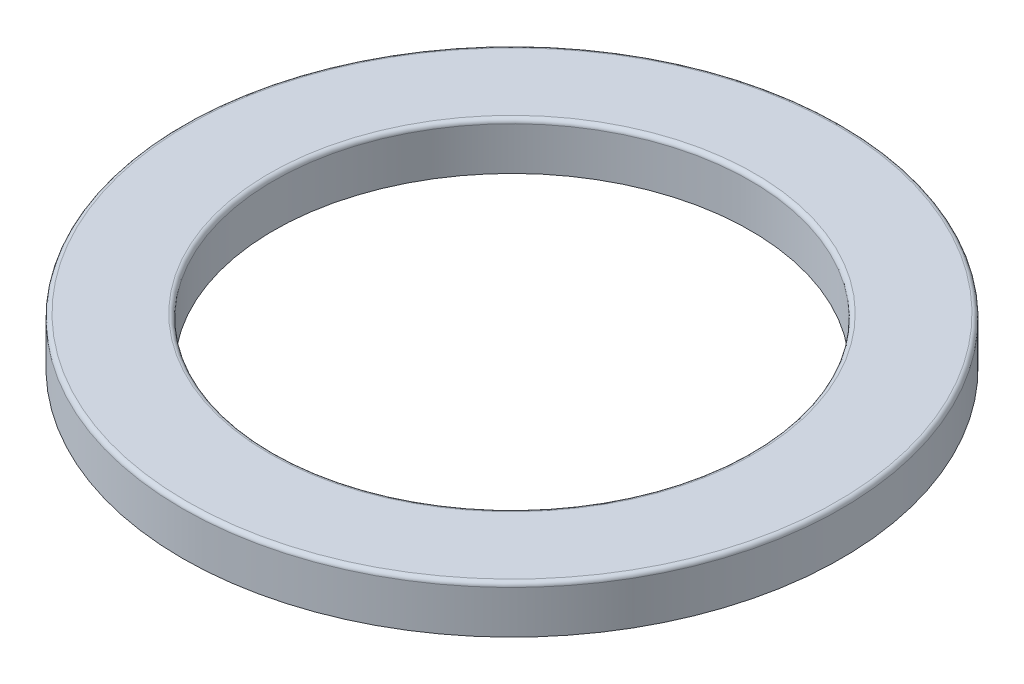
ISO-10303-21;
HEADER;
FILE_DESCRIPTION(('STEP AP214'),'2;1');
FILE_NAME('part.step','',(''),(''),'','','');
FILE_SCHEMA(('AUTOMOTIVE_DESIGN { 1 0 10303 214 1 1 1 1 }'));
ENDSEC;
DATA;
#1=APPLICATION_CONTEXT('core data for automotive mechanical design processes');
#2=APPLICATION_PROTOCOL_DEFINITION('international standard','automotive_design',2000,#1);
#3=PRODUCT_CONTEXT('',#1,'mechanical');
#4=PRODUCT('Part','Part','',(#3));
#5=PRODUCT_RELATED_PRODUCT_CATEGORY('part','',(#4));
#6=PRODUCT_DEFINITION_FORMATION('','',#4);
#7=PRODUCT_DEFINITION_CONTEXT('part definition',#1,'design');
#8=PRODUCT_DEFINITION('design','',#6,#7);
#9=PRODUCT_DEFINITION_SHAPE('','',#8);
#10=(LENGTH_UNIT() NAMED_UNIT(*) SI_UNIT(.MILLI.,.METRE.));
#11=(NAMED_UNIT(*) PLANE_ANGLE_UNIT() SI_UNIT($,.RADIAN.));
#12=(NAMED_UNIT(*) SI_UNIT($,.STERADIAN.) SOLID_ANGLE_UNIT());
#13=UNCERTAINTY_MEASURE_WITH_UNIT(LENGTH_MEASURE(1.E-05),#10,'distance_accuracy_value','');
#14=(GEOMETRIC_REPRESENTATION_CONTEXT(3) GLOBAL_UNCERTAINTY_ASSIGNED_CONTEXT((#13)) GLOBAL_UNIT_ASSIGNED_CONTEXT((#10,
#11,#12)) REPRESENTATION_CONTEXT('',''));
#15=CARTESIAN_POINT('',(0.,0.,0.));
#16=DIRECTION('',(0.,0.,1.));
#17=DIRECTION('',(1.,0.,0.));
#18=AXIS2_PLACEMENT_3D('',#15,#16,#17);
#19=CARTESIAN_POINT('',(0.,0.,0.));
#20=DIRECTION('',(0.,1.,0.));
#21=DIRECTION('',(0.,0.,1.));
#22=AXIS2_PLACEMENT_3D('',#19,#20,#21);
#23=PLANE('',#22);
#24=CARTESIAN_POINT('',(0.,0.,0.));
#25=DIRECTION('',(0.,1.,0.));
#26=DIRECTION('',(0.,0.,1.));
#27=AXIS2_PLACEMENT_3D('',#24,#25,#26);
#28=CIRCLE('',#27,85.);
#29=CARTESIAN_POINT('',(0.,0.,85.));
#30=VERTEX_POINT('',#29);
#31=EDGE_CURVE('E52',#30,#30,#28,.T.);
#32=ORIENTED_EDGE('',*,*,#31,.F.);
#33=EDGE_LOOP('',(#32));
#34=FACE_BOUND('',#33,.T.);
#35=CARTESIAN_POINT('',(0.,0.,0.));
#36=DIRECTION('',(0.,1.,0.));
#37=DIRECTION('',(0.,0.,1.));
#38=AXIS2_PLACEMENT_3D('',#35,#36,#37);
#39=CIRCLE('',#38,77.98);
#40=CARTESIAN_POINT('',(0.,0.,77.98));
#41=VERTEX_POINT('',#40);
#42=EDGE_CURVE('E61',#41,#41,#39,.T.);
#43=ORIENTED_EDGE('',*,*,#42,.T.);
#44=EDGE_LOOP('',(#43));
#45=FACE_BOUND('',#44,.T.);
#46=ADVANCED_FACE('F32',(#34,#45),#23,.F.);
#47=CARTESIAN_POINT('',(0.,0.,0.));
#48=DIRECTION('',(0.,1.,0.));
#49=DIRECTION('',(0.,0.,1.));
#50=AXIS2_PLACEMENT_3D('',#47,#48,#49);
#51=CIRCLE('',#50,61.5);
#52=CARTESIAN_POINT('',(0.,0.,61.5));
#53=VERTEX_POINT('',#52);
#54=EDGE_CURVE('E55',#53,#53,#51,.T.);
#55=ORIENTED_EDGE('',*,*,#54,.T.);
#56=EDGE_LOOP('',(#55));
#57=FACE_BOUND('',#56,.T.);
#58=CARTESIAN_POINT('',(0.,0.,0.));
#59=DIRECTION('',(0.,1.,0.));
#60=DIRECTION('',(0.,0.,1.));
#61=AXIS2_PLACEMENT_3D('',#58,#59,#60);
#62=CIRCLE('',#61,67.02);
#63=CARTESIAN_POINT('',(0.,0.,67.02));
#64=VERTEX_POINT('',#63);
#65=EDGE_CURVE('E58',#64,#64,#62,.T.);
#66=ORIENTED_EDGE('',*,*,#65,.F.);
#67=EDGE_LOOP('',(#66));
#68=FACE_BOUND('',#67,.T.);
#69=ADVANCED_FACE('F72',(#57,#68),#23,.F.);
#70=CARTESIAN_POINT('',(0.,12.2,0.));
#71=DIRECTION('',(0.,1.,0.));
#72=DIRECTION('',(0.,0.,1.));
#73=AXIS2_PLACEMENT_3D('',#70,#71,#72);
#74=PLANE('',#73);
#75=CARTESIAN_POINT('',(0.,12.2,0.));
#76=DIRECTION('',(0.,1.,0.));
#77=DIRECTION('',(0.,0.,1.));
#78=AXIS2_PLACEMENT_3D('',#75,#76,#77);
#79=CIRCLE('',#78,62.6);
#80=CARTESIAN_POINT('',(0.,12.2,62.6));
#81=VERTEX_POINT('',#80);
#82=EDGE_CURVE('E39',#81,#81,#79,.F.);
#83=ORIENTED_EDGE('',*,*,#82,.T.);
#84=EDGE_LOOP('',(#83));
#85=FACE_BOUND('',#84,.T.);
#86=CARTESIAN_POINT('',(0.,12.2,0.));
#87=DIRECTION('',(0.,1.,0.));
#88=DIRECTION('',(0.,0.,1.));
#89=AXIS2_PLACEMENT_3D('',#86,#87,#88);
#90=CIRCLE('',#89,83.9);
#91=CARTESIAN_POINT('',(0.,12.2,83.9));
#92=VERTEX_POINT('',#91);
#93=EDGE_CURVE('E43',#92,#92,#90,.T.);
#94=ORIENTED_EDGE('',*,*,#93,.T.);
#95=EDGE_LOOP('',(#94));
#96=FACE_BOUND('',#95,.T.);
#97=ADVANCED_FACE('F74',(#85,#96),#74,.T.);
#98=CARTESIAN_POINT('',(0.,12.2,0.));
#99=DIRECTION('',(0.,-1.,0.));
#100=DIRECTION('',(0.,0.,-1.));
#101=AXIS2_PLACEMENT_3D('',#98,#99,#100);
#102=CYLINDRICAL_SURFACE('',#101,85.);
#103=CARTESIAN_POINT('',(0.,11.1,0.));
#104=DIRECTION('',(0.,1.,0.));
#105=DIRECTION('',(0.,0.,1.));
#106=AXIS2_PLACEMENT_3D('',#103,#104,#105);
#107=CIRCLE('',#106,85.);
#108=CARTESIAN_POINT('',(0.,11.1,85.));
#109=VERTEX_POINT('',#108);
#110=EDGE_CURVE('E10',#109,#109,#107,.F.);
#111=ORIENTED_EDGE('',*,*,#110,.T.);
#112=EDGE_LOOP('',(#111));
#113=FACE_BOUND('',#112,.T.);
#114=ORIENTED_EDGE('',*,*,#31,.T.);
#115=EDGE_LOOP('',(#114));
#116=FACE_BOUND('',#115,.T.);
#117=ADVANCED_FACE('F81',(#113,#116),#102,.T.);
#118=CARTESIAN_POINT('',(0.,12.2,0.));
#119=DIRECTION('',(0.,-1.,0.));
#120=DIRECTION('',(0.,0.,-1.));
#121=AXIS2_PLACEMENT_3D('',#118,#119,#120);
#122=CYLINDRICAL_SURFACE('',#121,61.5);
#123=CARTESIAN_POINT('',(0.,11.1,0.));
#124=DIRECTION('',(0.,1.,0.));
#125=DIRECTION('',(0.,0.,1.));
#126=AXIS2_PLACEMENT_3D('',#123,#124,#125);
#127=CIRCLE('',#126,61.5);
#128=CARTESIAN_POINT('',(0.,11.1,61.5));
#129=VERTEX_POINT('',#128);
#130=EDGE_CURVE('E47',#129,#129,#127,.T.);
#131=ORIENTED_EDGE('',*,*,#130,.T.);
#132=EDGE_LOOP('',(#131));
#133=FACE_BOUND('',#132,.T.);
#134=ORIENTED_EDGE('',*,*,#54,.F.);
#135=EDGE_LOOP('',(#134));
#136=FACE_BOUND('',#135,.T.);
#137=ADVANCED_FACE('F87',(#133,#136),#122,.F.);
#138=CARTESIAN_POINT('',(0.,11.1,0.));
#139=DIRECTION('',(0.,1.,0.));
#140=DIRECTION('',(0.,0.,1.));
#141=AXIS2_PLACEMENT_3D('',#138,#139,#140);
#142=TOROIDAL_SURFACE('',#141,62.6,1.1);
#143=ORIENTED_EDGE('',*,*,#82,.F.);
#144=EDGE_LOOP('',(#143));
#145=FACE_BOUND('',#144,.T.);
#146=ORIENTED_EDGE('',*,*,#130,.F.);
#147=EDGE_LOOP('',(#146));
#148=FACE_BOUND('',#147,.T.);
#149=ADVANCED_FACE('F88',(#145,#148),#142,.T.);
#150=CARTESIAN_POINT('',(0.,11.1,0.));
#151=DIRECTION('',(0.,1.,0.));
#152=DIRECTION('',(0.,0.,1.));
#153=AXIS2_PLACEMENT_3D('',#150,#151,#152);
#154=TOROIDAL_SURFACE('',#153,83.9,1.1);
#155=ORIENTED_EDGE('',*,*,#110,.F.);
#156=EDGE_LOOP('',(#155));
#157=FACE_BOUND('',#156,.T.);
#158=ORIENTED_EDGE('',*,*,#93,.F.);
#159=EDGE_LOOP('',(#158));
#160=FACE_BOUND('',#159,.T.);
#161=ADVANCED_FACE('F34',(#157,#160),#154,.T.);
#162=CARTESIAN_POINT('',(0.,-7.30249957206435,0.));
#163=DIRECTION('',(0.,1.,0.));
#164=DIRECTION('',(0.,0.,1.));
#165=AXIS2_PLACEMENT_3D('',#162,#163,#164);
#166=TOROIDAL_SURFACE('',#165,72.5,9.13);
#167=ORIENTED_EDGE('',*,*,#42,.F.);
#168=EDGE_LOOP('',(#167));
#169=FACE_BOUND('',#168,.T.);
#170=ORIENTED_EDGE('',*,*,#65,.T.);
#171=EDGE_LOOP('',(#170));
#172=FACE_BOUND('',#171,.T.);
#173=ADVANCED_FACE('F66',(#169,#172),#166,.F.);
#174=CLOSED_SHELL('',(#46,#69,#97,#117,#137,#149,#161,#173));
#175=MANIFOLD_SOLID_BREP('B2',#174);
#176=ADVANCED_BREP_SHAPE_REPRESENTATION('',(#18,#175),#14);
#177=SHAPE_DEFINITION_REPRESENTATION(#9,#176);
ENDSEC;
END-ISO-10303-21;
